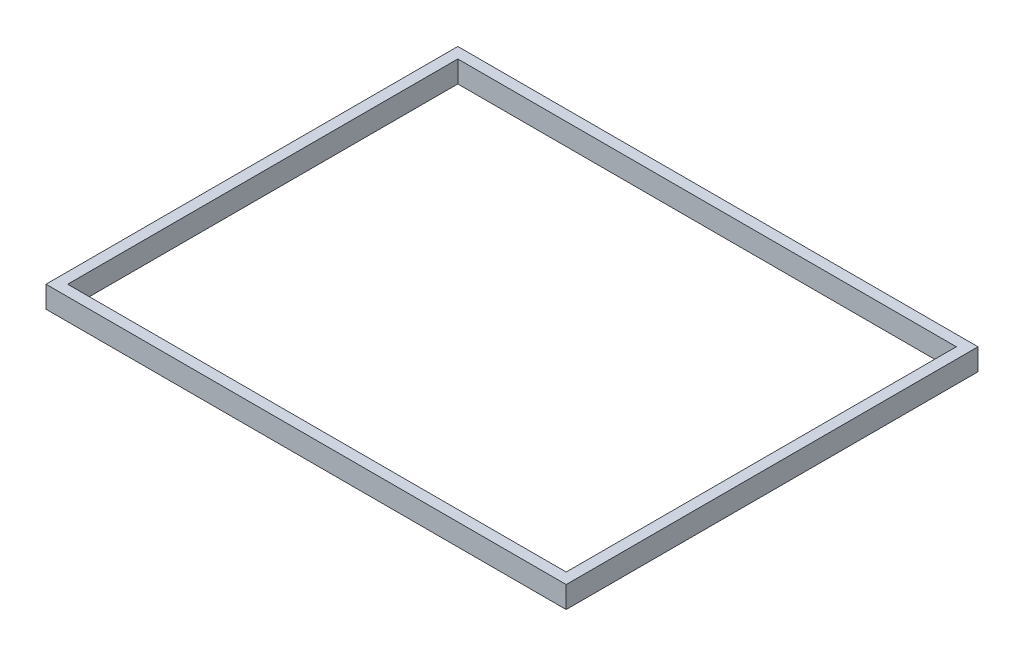
ISO-10303-21;
HEADER;
FILE_DESCRIPTION(('STEP AP214'),'2;1');
FILE_NAME('part.step','',(''),(''),'','','');
FILE_SCHEMA(('AUTOMOTIVE_DESIGN { 1 0 10303 214 1 1 1 1 }'));
ENDSEC;
DATA;
#1=APPLICATION_CONTEXT('core data for automotive mechanical design processes');
#2=APPLICATION_PROTOCOL_DEFINITION('international standard','automotive_design',2000,#1);
#3=PRODUCT_CONTEXT('',#1,'mechanical');
#4=PRODUCT('Part','Part','',(#3));
#5=PRODUCT_RELATED_PRODUCT_CATEGORY('part','',(#4));
#6=PRODUCT_DEFINITION_FORMATION('','',#4);
#7=PRODUCT_DEFINITION_CONTEXT('part definition',#1,'design');
#8=PRODUCT_DEFINITION('design','',#6,#7);
#9=PRODUCT_DEFINITION_SHAPE('','',#8);
#10=(LENGTH_UNIT() NAMED_UNIT(*) SI_UNIT(.MILLI.,.METRE.));
#11=(NAMED_UNIT(*) PLANE_ANGLE_UNIT() SI_UNIT($,.RADIAN.));
#12=(NAMED_UNIT(*) SI_UNIT($,.STERADIAN.) SOLID_ANGLE_UNIT());
#13=UNCERTAINTY_MEASURE_WITH_UNIT(LENGTH_MEASURE(1.E-05),#10,'distance_accuracy_value','');
#14=(GEOMETRIC_REPRESENTATION_CONTEXT(3) GLOBAL_UNCERTAINTY_ASSIGNED_CONTEXT((#13)) GLOBAL_UNIT_ASSIGNED_CONTEXT((#10,
#11,#12)) REPRESENTATION_CONTEXT('',''));
#15=CARTESIAN_POINT('',(0.,0.,0.));
#16=DIRECTION('',(0.,0.,1.));
#17=DIRECTION('',(1.,0.,0.));
#18=AXIS2_PLACEMENT_3D('',#15,#16,#17);
#19=CARTESIAN_POINT('',(0.,20.,0.));
#20=DIRECTION('',(0.,-1.,0.));
#21=DIRECTION('',(0.,0.,-1.));
#22=AXIS2_PLACEMENT_3D('',#19,#20,#21);
#23=PLANE('',#22);
#24=DIRECTION('',(0.,0.,-1.));
#25=VECTOR('',#24,1.);
#26=CARTESIAN_POINT('',(240.,20.,190.));
#27=LINE('',#26,#25);
#28=CARTESIAN_POINT('',(240.,20.,190.));
#29=VERTEX_POINT('',#28);
#30=CARTESIAN_POINT('',(240.,20.,-190.));
#31=VERTEX_POINT('',#30);
#32=EDGE_CURVE('E134',#29,#31,#27,.T.);
#33=ORIENTED_EDGE('',*,*,#32,.T.);
#34=DIRECTION('',(-1.,0.,0.));
#35=VECTOR('',#34,1.);
#36=CARTESIAN_POINT('',(-240.,20.,-190.));
#37=LINE('',#36,#35);
#38=CARTESIAN_POINT('',(-240.,20.,-190.));
#39=VERTEX_POINT('',#38);
#40=EDGE_CURVE('E137',#31,#39,#37,.T.);
#41=ORIENTED_EDGE('',*,*,#40,.T.);
#42=DIRECTION('',(0.,0.,1.));
#43=VECTOR('',#42,1.);
#44=CARTESIAN_POINT('',(-240.,20.,190.));
#45=LINE('',#44,#43);
#46=CARTESIAN_POINT('',(-240.,20.,190.));
#47=VERTEX_POINT('',#46);
#48=EDGE_CURVE('E140',#39,#47,#45,.T.);
#49=ORIENTED_EDGE('',*,*,#48,.T.);
#50=DIRECTION('',(1.,0.,0.));
#51=VECTOR('',#50,1.);
#52=CARTESIAN_POINT('',(-240.,20.,190.));
#53=LINE('',#52,#51);
#54=EDGE_CURVE('E142',#47,#29,#53,.T.);
#55=ORIENTED_EDGE('',*,*,#54,.T.);
#56=EDGE_LOOP('',(#33,#41,#49,#55));
#57=FACE_BOUND('',#56,.T.);
#58=DIRECTION('',(0.,0.,1.));
#59=VECTOR('',#58,1.);
#60=CARTESIAN_POINT('',(-230.,20.,180.));
#61=LINE('',#60,#59);
#62=CARTESIAN_POINT('',(-230.,20.,-180.));
#63=VERTEX_POINT('',#62);
#64=CARTESIAN_POINT('',(-230.,20.,180.));
#65=VERTEX_POINT('',#64);
#66=EDGE_CURVE('E98',#63,#65,#61,.T.);
#67=ORIENTED_EDGE('',*,*,#66,.F.);
#68=DIRECTION('',(-1.,0.,0.));
#69=VECTOR('',#68,1.);
#70=CARTESIAN_POINT('',(-230.,20.,-180.));
#71=LINE('',#70,#69);
#72=CARTESIAN_POINT('',(230.,20.,-180.));
#73=VERTEX_POINT('',#72);
#74=EDGE_CURVE('E120',#73,#63,#71,.T.);
#75=ORIENTED_EDGE('',*,*,#74,.F.);
#76=DIRECTION('',(0.,0.,-1.));
#77=VECTOR('',#76,1.);
#78=CARTESIAN_POINT('',(230.,20.,180.));
#79=LINE('',#78,#77);
#80=CARTESIAN_POINT('',(230.,20.,180.));
#81=VERTEX_POINT('',#80);
#82=EDGE_CURVE('E118',#81,#73,#79,.T.);
#83=ORIENTED_EDGE('',*,*,#82,.F.);
#84=DIRECTION('',(1.,0.,0.));
#85=VECTOR('',#84,1.);
#86=CARTESIAN_POINT('',(-230.,20.,180.));
#87=LINE('',#86,#85);
#88=EDGE_CURVE('E106',#65,#81,#87,.T.);
#89=ORIENTED_EDGE('',*,*,#88,.F.);
#90=EDGE_LOOP('',(#67,#75,#83,#89));
#91=FACE_BOUND('',#90,.T.);
#92=ADVANCED_FACE('F33',(#57,#91),#23,.F.);
#93=CARTESIAN_POINT('',(0.,0.,0.));
#94=DIRECTION('',(0.,-1.,0.));
#95=DIRECTION('',(0.,0.,-1.));
#96=AXIS2_PLACEMENT_3D('',#93,#94,#95);
#97=PLANE('',#96);
#98=DIRECTION('',(0.,0.,-1.));
#99=VECTOR('',#98,1.);
#100=CARTESIAN_POINT('',(240.,0.,190.));
#101=LINE('',#100,#99);
#102=CARTESIAN_POINT('',(240.,0.,190.));
#103=VERTEX_POINT('',#102);
#104=CARTESIAN_POINT('',(240.,0.,-190.));
#105=VERTEX_POINT('',#104);
#106=EDGE_CURVE('E114',#103,#105,#101,.T.);
#107=ORIENTED_EDGE('',*,*,#106,.F.);
#108=DIRECTION('',(1.,0.,0.));
#109=VECTOR('',#108,1.);
#110=CARTESIAN_POINT('',(-240.,0.,190.));
#111=LINE('',#110,#109);
#112=CARTESIAN_POINT('',(-240.,0.,190.));
#113=VERTEX_POINT('',#112);
#114=EDGE_CURVE('E138',#113,#103,#111,.T.);
#115=ORIENTED_EDGE('',*,*,#114,.F.);
#116=DIRECTION('',(0.,0.,1.));
#117=VECTOR('',#116,1.);
#118=CARTESIAN_POINT('',(-240.,0.,190.));
#119=LINE('',#118,#117);
#120=CARTESIAN_POINT('',(-240.,0.,-190.));
#121=VERTEX_POINT('',#120);
#122=EDGE_CURVE('E149',#121,#113,#119,.T.);
#123=ORIENTED_EDGE('',*,*,#122,.F.);
#124=DIRECTION('',(-1.,0.,0.));
#125=VECTOR('',#124,1.);
#126=CARTESIAN_POINT('',(-240.,0.,-190.));
#127=LINE('',#126,#125);
#128=EDGE_CURVE('E147',#105,#121,#127,.T.);
#129=ORIENTED_EDGE('',*,*,#128,.F.);
#130=EDGE_LOOP('',(#107,#115,#123,#129));
#131=FACE_BOUND('',#130,.T.);
#132=DIRECTION('',(-1.,0.,0.));
#133=VECTOR('',#132,1.);
#134=CARTESIAN_POINT('',(-230.,0.,-180.));
#135=LINE('',#134,#133);
#136=CARTESIAN_POINT('',(230.,0.,-180.));
#137=VERTEX_POINT('',#136);
#138=CARTESIAN_POINT('',(-230.,0.,-180.));
#139=VERTEX_POINT('',#138);
#140=EDGE_CURVE('E107',#137,#139,#135,.T.);
#141=ORIENTED_EDGE('',*,*,#140,.T.);
#142=DIRECTION('',(0.,0.,1.));
#143=VECTOR('',#142,1.);
#144=CARTESIAN_POINT('',(-230.,0.,180.));
#145=LINE('',#144,#143);
#146=CARTESIAN_POINT('',(-230.,0.,180.));
#147=VERTEX_POINT('',#146);
#148=EDGE_CURVE('E56',#139,#147,#145,.T.);
#149=ORIENTED_EDGE('',*,*,#148,.T.);
#150=DIRECTION('',(1.,0.,0.));
#151=VECTOR('',#150,1.);
#152=CARTESIAN_POINT('',(-230.,0.,180.));
#153=LINE('',#152,#151);
#154=CARTESIAN_POINT('',(230.,0.,180.));
#155=VERTEX_POINT('',#154);
#156=EDGE_CURVE('E113',#147,#155,#153,.T.);
#157=ORIENTED_EDGE('',*,*,#156,.T.);
#158=DIRECTION('',(0.,0.,-1.));
#159=VECTOR('',#158,1.);
#160=CARTESIAN_POINT('',(230.,0.,180.));
#161=LINE('',#160,#159);
#162=EDGE_CURVE('E126',#155,#137,#161,.T.);
#163=ORIENTED_EDGE('',*,*,#162,.T.);
#164=EDGE_LOOP('',(#141,#149,#157,#163));
#165=FACE_BOUND('',#164,.T.);
#166=ADVANCED_FACE('F167',(#131,#165),#97,.T.);
#167=CARTESIAN_POINT('',(240.,20.,190.));
#168=DIRECTION('',(-1.,0.,0.));
#169=DIRECTION('',(0.,0.,1.));
#170=AXIS2_PLACEMENT_3D('',#167,#168,#169);
#171=PLANE('',#170);
#172=ORIENTED_EDGE('',*,*,#106,.T.);
#173=DIRECTION('',(0.,-1.,0.));
#174=VECTOR('',#173,1.);
#175=CARTESIAN_POINT('',(240.,20.,-190.));
#176=LINE('',#175,#174);
#177=EDGE_CURVE('E11',#31,#105,#176,.T.);
#178=ORIENTED_EDGE('',*,*,#177,.F.);
#179=ORIENTED_EDGE('',*,*,#32,.F.);
#180=DIRECTION('',(0.,-1.,0.));
#181=VECTOR('',#180,1.);
#182=CARTESIAN_POINT('',(240.,20.,190.));
#183=LINE('',#182,#181);
#184=EDGE_CURVE('E144',#29,#103,#183,.T.);
#185=ORIENTED_EDGE('',*,*,#184,.T.);
#186=EDGE_LOOP('',(#172,#178,#179,#185));
#187=FACE_BOUND('',#186,.T.);
#188=ADVANCED_FACE('F35',(#187),#171,.F.);
#189=CARTESIAN_POINT('',(-240.,20.,-190.));
#190=DIRECTION('',(0.,0.,1.));
#191=DIRECTION('',(1.,0.,0.));
#192=AXIS2_PLACEMENT_3D('',#189,#190,#191);
#193=PLANE('',#192);
#194=ORIENTED_EDGE('',*,*,#128,.T.);
#195=DIRECTION('',(0.,-1.,0.));
#196=VECTOR('',#195,1.);
#197=CARTESIAN_POINT('',(-240.,20.,-190.));
#198=LINE('',#197,#196);
#199=EDGE_CURVE('E41',#39,#121,#198,.T.);
#200=ORIENTED_EDGE('',*,*,#199,.F.);
#201=ORIENTED_EDGE('',*,*,#40,.F.);
#202=ORIENTED_EDGE('',*,*,#177,.T.);
#203=EDGE_LOOP('',(#194,#200,#201,#202));
#204=FACE_BOUND('',#203,.T.);
#205=ADVANCED_FACE('F177',(#204),#193,.F.);
#206=CARTESIAN_POINT('',(-240.,20.,190.));
#207=DIRECTION('',(1.,0.,0.));
#208=DIRECTION('',(0.,0.,-1.));
#209=AXIS2_PLACEMENT_3D('',#206,#207,#208);
#210=PLANE('',#209);
#211=ORIENTED_EDGE('',*,*,#122,.T.);
#212=DIRECTION('',(0.,-1.,0.));
#213=VECTOR('',#212,1.);
#214=CARTESIAN_POINT('',(-240.,20.,190.));
#215=LINE('',#214,#213);
#216=EDGE_CURVE('E154',#47,#113,#215,.T.);
#217=ORIENTED_EDGE('',*,*,#216,.F.);
#218=ORIENTED_EDGE('',*,*,#48,.F.);
#219=ORIENTED_EDGE('',*,*,#199,.T.);
#220=EDGE_LOOP('',(#211,#217,#218,#219));
#221=FACE_BOUND('',#220,.T.);
#222=ADVANCED_FACE('F161',(#221),#210,.F.);
#223=CARTESIAN_POINT('',(-240.,20.,190.));
#224=DIRECTION('',(0.,0.,-1.));
#225=DIRECTION('',(-1.,0.,0.));
#226=AXIS2_PLACEMENT_3D('',#223,#224,#225);
#227=PLANE('',#226);
#228=ORIENTED_EDGE('',*,*,#114,.T.);
#229=ORIENTED_EDGE('',*,*,#184,.F.);
#230=ORIENTED_EDGE('',*,*,#54,.F.);
#231=ORIENTED_EDGE('',*,*,#216,.T.);
#232=EDGE_LOOP('',(#228,#229,#230,#231));
#233=FACE_BOUND('',#232,.T.);
#234=ADVANCED_FACE('F171',(#233),#227,.F.);
#235=CARTESIAN_POINT('',(-230.,20.,180.));
#236=DIRECTION('',(1.,0.,0.));
#237=DIRECTION('',(0.,0.,-1.));
#238=AXIS2_PLACEMENT_3D('',#235,#236,#237);
#239=PLANE('',#238);
#240=ORIENTED_EDGE('',*,*,#148,.F.);
#241=DIRECTION('',(0.,-1.,0.));
#242=VECTOR('',#241,1.);
#243=CARTESIAN_POINT('',(-230.,20.,-180.));
#244=LINE('',#243,#242);
#245=EDGE_CURVE('E102',#63,#139,#244,.T.);
#246=ORIENTED_EDGE('',*,*,#245,.F.);
#247=ORIENTED_EDGE('',*,*,#66,.T.);
#248=DIRECTION('',(0.,-1.,0.));
#249=VECTOR('',#248,1.);
#250=CARTESIAN_POINT('',(-230.,20.,180.));
#251=LINE('',#250,#249);
#252=EDGE_CURVE('E101',#65,#147,#251,.T.);
#253=ORIENTED_EDGE('',*,*,#252,.T.);
#254=EDGE_LOOP('',(#240,#246,#247,#253));
#255=FACE_BOUND('',#254,.T.);
#256=ADVANCED_FACE('F100',(#255),#239,.T.);
#257=CARTESIAN_POINT('',(-230.,20.,180.));
#258=DIRECTION('',(0.,0.,-1.));
#259=DIRECTION('',(-1.,0.,0.));
#260=AXIS2_PLACEMENT_3D('',#257,#258,#259);
#261=PLANE('',#260);
#262=ORIENTED_EDGE('',*,*,#156,.F.);
#263=ORIENTED_EDGE('',*,*,#252,.F.);
#264=ORIENTED_EDGE('',*,*,#88,.T.);
#265=DIRECTION('',(0.,-1.,0.));
#266=VECTOR('',#265,1.);
#267=CARTESIAN_POINT('',(230.,20.,180.));
#268=LINE('',#267,#266);
#269=EDGE_CURVE('E115',#81,#155,#268,.T.);
#270=ORIENTED_EDGE('',*,*,#269,.T.);
#271=EDGE_LOOP('',(#262,#263,#264,#270));
#272=FACE_BOUND('',#271,.T.);
#273=ADVANCED_FACE('F110',(#272),#261,.T.);
#274=CARTESIAN_POINT('',(230.,20.,180.));
#275=DIRECTION('',(-1.,0.,0.));
#276=DIRECTION('',(0.,0.,1.));
#277=AXIS2_PLACEMENT_3D('',#274,#275,#276);
#278=PLANE('',#277);
#279=ORIENTED_EDGE('',*,*,#162,.F.);
#280=ORIENTED_EDGE('',*,*,#269,.F.);
#281=ORIENTED_EDGE('',*,*,#82,.T.);
#282=DIRECTION('',(0.,-1.,0.));
#283=VECTOR('',#282,1.);
#284=CARTESIAN_POINT('',(230.,20.,-180.));
#285=LINE('',#284,#283);
#286=EDGE_CURVE('E48',#73,#137,#285,.T.);
#287=ORIENTED_EDGE('',*,*,#286,.T.);
#288=EDGE_LOOP('',(#279,#280,#281,#287));
#289=FACE_BOUND('',#288,.T.);
#290=ADVANCED_FACE('F200',(#289),#278,.T.);
#291=CARTESIAN_POINT('',(-230.,20.,-180.));
#292=DIRECTION('',(0.,0.,1.));
#293=DIRECTION('',(1.,0.,0.));
#294=AXIS2_PLACEMENT_3D('',#291,#292,#293);
#295=PLANE('',#294);
#296=ORIENTED_EDGE('',*,*,#140,.F.);
#297=ORIENTED_EDGE('',*,*,#286,.F.);
#298=ORIENTED_EDGE('',*,*,#74,.T.);
#299=ORIENTED_EDGE('',*,*,#245,.T.);
#300=EDGE_LOOP('',(#296,#297,#298,#299));
#301=FACE_BOUND('',#300,.T.);
#302=ADVANCED_FACE('F204',(#301),#295,.T.);
#303=CLOSED_SHELL('',(#92,#166,#188,#205,#222,#234,#256,#273,#290,#302));
#304=MANIFOLD_SOLID_BREP('B2',#303);
#305=ADVANCED_BREP_SHAPE_REPRESENTATION('',(#18,#304),#14);
#306=SHAPE_DEFINITION_REPRESENTATION(#9,#305);
ENDSEC;
END-ISO-10303-21;
